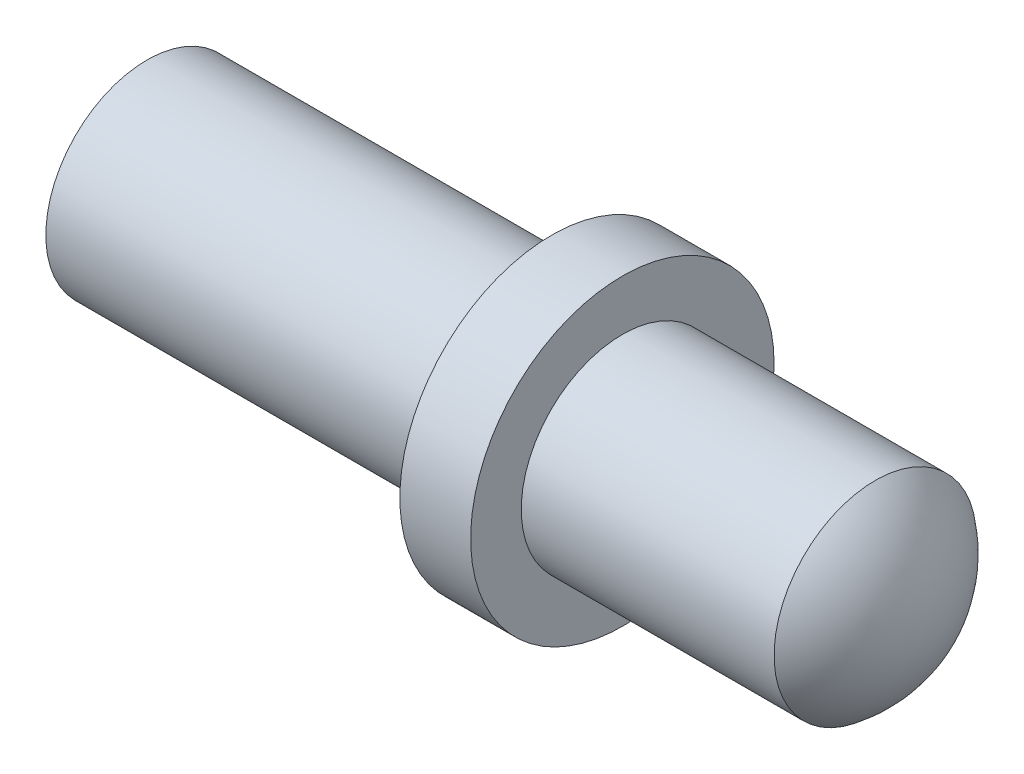
ISO-10303-21;
HEADER;
FILE_DESCRIPTION(('STEP AP214'),'2;1');
FILE_NAME('part.step','',(''),(''),'','','');
FILE_SCHEMA(('AUTOMOTIVE_DESIGN { 1 0 10303 214 1 1 1 1 }'));
ENDSEC;
DATA;
#1=APPLICATION_CONTEXT('core data for automotive mechanical design processes');
#2=APPLICATION_PROTOCOL_DEFINITION('international standard','automotive_design',2000,#1);
#3=PRODUCT_CONTEXT('',#1,'mechanical');
#4=PRODUCT('Part','Part','',(#3));
#5=PRODUCT_RELATED_PRODUCT_CATEGORY('part','',(#4));
#6=PRODUCT_DEFINITION_FORMATION('','',#4);
#7=PRODUCT_DEFINITION_CONTEXT('part definition',#1,'design');
#8=PRODUCT_DEFINITION('design','',#6,#7);
#9=PRODUCT_DEFINITION_SHAPE('','',#8);
#10=(LENGTH_UNIT() NAMED_UNIT(*) SI_UNIT(.MILLI.,.METRE.));
#11=(NAMED_UNIT(*) PLANE_ANGLE_UNIT() SI_UNIT($,.RADIAN.));
#12=(NAMED_UNIT(*) SI_UNIT($,.STERADIAN.) SOLID_ANGLE_UNIT());
#13=UNCERTAINTY_MEASURE_WITH_UNIT(LENGTH_MEASURE(1.E-05),#10,'distance_accuracy_value','');
#14=(GEOMETRIC_REPRESENTATION_CONTEXT(3) GLOBAL_UNCERTAINTY_ASSIGNED_CONTEXT((#13)) GLOBAL_UNIT_ASSIGNED_CONTEXT((#10,
#11,#12)) REPRESENTATION_CONTEXT('',''));
#15=CARTESIAN_POINT('',(0.,0.,0.));
#16=DIRECTION('',(0.,0.,1.));
#17=DIRECTION('',(1.,0.,0.));
#18=AXIS2_PLACEMENT_3D('',#15,#16,#17);
#19=CARTESIAN_POINT('',(0.,0.,0.));
#20=DIRECTION('',(-1.,0.,0.));
#21=DIRECTION('',(0.,0.,1.));
#22=AXIS2_PLACEMENT_3D('',#19,#20,#21);
#23=PLANE('',#22);
#24=CARTESIAN_POINT('',(0.,0.,0.));
#25=DIRECTION('',(1.,0.,0.));
#26=DIRECTION('',(0.,0.,-1.));
#27=AXIS2_PLACEMENT_3D('',#24,#25,#26);
#28=CIRCLE('',#27,2.);
#29=CARTESIAN_POINT('',(0.,0.,-2.));
#30=VERTEX_POINT('',#29);
#31=EDGE_CURVE('E10',#30,#30,#28,.T.);
#32=ORIENTED_EDGE('',*,*,#31,.F.);
#33=EDGE_LOOP('',(#32));
#34=FACE_BOUND('',#33,.T.);
#35=ADVANCED_FACE('F30',(#34),#23,.T.);
#36=CARTESIAN_POINT('',(14.4,0.,0.));
#37=DIRECTION('',(1.,0.,0.));
#38=DIRECTION('',(0.,0.,-1.));
#39=AXIS2_PLACEMENT_3D('',#36,#37,#38);
#40=CYLINDRICAL_SURFACE('',#39,2.);
#41=ORIENTED_EDGE('',*,*,#31,.T.);
#42=EDGE_LOOP('',(#41));
#43=FACE_BOUND('',#42,.T.);
#44=CARTESIAN_POINT('',(8.,0.,0.));
#45=DIRECTION('',(1.,0.,0.));
#46=DIRECTION('',(0.,0.,-1.));
#47=AXIS2_PLACEMENT_3D('',#44,#45,#46);
#48=CIRCLE('',#47,2.);
#49=CARTESIAN_POINT('',(8.,0.,-2.));
#50=VERTEX_POINT('',#49);
#51=EDGE_CURVE('E38',#50,#50,#48,.T.);
#52=ORIENTED_EDGE('',*,*,#51,.F.);
#53=EDGE_LOOP('',(#52));
#54=FACE_BOUND('',#53,.T.);
#55=ADVANCED_FACE('F74',(#43,#54),#40,.T.);
#56=CARTESIAN_POINT('',(8.,2.,0.));
#57=DIRECTION('',(-1.,0.,0.));
#58=DIRECTION('',(0.,0.,1.));
#59=AXIS2_PLACEMENT_3D('',#56,#57,#58);
#60=PLANE('',#59);
#61=ORIENTED_EDGE('',*,*,#51,.T.);
#62=EDGE_LOOP('',(#61));
#63=FACE_BOUND('',#62,.T.);
#64=CARTESIAN_POINT('',(8.,0.,0.));
#65=DIRECTION('',(1.,0.,0.));
#66=DIRECTION('',(0.,0.,-1.));
#67=AXIS2_PLACEMENT_3D('',#64,#65,#66);
#68=CIRCLE('',#67,3.);
#69=CARTESIAN_POINT('',(8.,0.,-3.));
#70=VERTEX_POINT('',#69);
#71=EDGE_CURVE('E42',#70,#70,#68,.T.);
#72=ORIENTED_EDGE('',*,*,#71,.F.);
#73=EDGE_LOOP('',(#72));
#74=FACE_BOUND('',#73,.T.);
#75=ADVANCED_FACE('F78',(#63,#74),#60,.T.);
#76=CARTESIAN_POINT('',(14.4,0.,0.));
#77=DIRECTION('',(1.,0.,0.));
#78=DIRECTION('',(0.,0.,-1.));
#79=AXIS2_PLACEMENT_3D('',#76,#77,#78);
#80=CYLINDRICAL_SURFACE('',#79,3.);
#81=ORIENTED_EDGE('',*,*,#71,.T.);
#82=EDGE_LOOP('',(#81));
#83=FACE_BOUND('',#82,.T.);
#84=CARTESIAN_POINT('',(9.4,0.,0.));
#85=DIRECTION('',(1.,0.,0.));
#86=DIRECTION('',(0.,0.,-1.));
#87=AXIS2_PLACEMENT_3D('',#84,#85,#86);
#88=CIRCLE('',#87,3.);
#89=CARTESIAN_POINT('',(9.4,0.,-3.));
#90=VERTEX_POINT('',#89);
#91=EDGE_CURVE('E47',#90,#90,#88,.T.);
#92=ORIENTED_EDGE('',*,*,#91,.F.);
#93=EDGE_LOOP('',(#92));
#94=FACE_BOUND('',#93,.T.);
#95=ADVANCED_FACE('F70',(#83,#94),#80,.T.);
#96=CARTESIAN_POINT('',(9.4,3.,0.));
#97=DIRECTION('',(1.,0.,0.));
#98=DIRECTION('',(0.,0.,-1.));
#99=AXIS2_PLACEMENT_3D('',#96,#97,#98);
#100=PLANE('',#99);
#101=ORIENTED_EDGE('',*,*,#91,.T.);
#102=EDGE_LOOP('',(#101));
#103=FACE_BOUND('',#102,.T.);
#104=CARTESIAN_POINT('',(9.4,0.,0.));
#105=DIRECTION('',(1.,0.,0.));
#106=DIRECTION('',(0.,0.,-1.));
#107=AXIS2_PLACEMENT_3D('',#104,#105,#106);
#108=CIRCLE('',#107,1.99999999999999);
#109=CARTESIAN_POINT('',(9.4,0.,-1.99999999999999));
#110=VERTEX_POINT('',#109);
#111=EDGE_CURVE('E50',#110,#110,#108,.T.);
#112=ORIENTED_EDGE('',*,*,#111,.F.);
#113=EDGE_LOOP('',(#112));
#114=FACE_BOUND('',#113,.T.);
#115=ADVANCED_FACE('F64',(#103,#114),#100,.T.);
#116=CARTESIAN_POINT('',(14.4,0.,0.));
#117=DIRECTION('',(1.,0.,0.));
#118=DIRECTION('',(0.,0.,-1.));
#119=AXIS2_PLACEMENT_3D('',#116,#117,#118);
#120=CYLINDRICAL_SURFACE('',#119,1.99999999999999);
#121=ORIENTED_EDGE('',*,*,#111,.T.);
#122=EDGE_LOOP('',(#121));
#123=FACE_BOUND('',#122,.T.);
#124=CARTESIAN_POINT('',(14.4,0.,0.));
#125=DIRECTION('',(1.,0.,0.));
#126=DIRECTION('',(0.,0.,-1.));
#127=AXIS2_PLACEMENT_3D('',#124,#125,#126);
#128=CIRCLE('',#127,1.99999999999999);
#129=CARTESIAN_POINT('',(14.4,0.,-1.99999999999999));
#130=VERTEX_POINT('',#129);
#131=EDGE_CURVE('E34',#130,#130,#128,.T.);
#132=ORIENTED_EDGE('',*,*,#131,.F.);
#133=EDGE_LOOP('',(#132));
#134=FACE_BOUND('',#133,.T.);
#135=ADVANCED_FACE('F62',(#123,#134),#120,.T.);
#136=CARTESIAN_POINT('',(12.9,0.,0.));
#137=DIRECTION('',(0.,0.,1.));
#138=DIRECTION('',(1.,0.,0.));
#139=AXIS2_PLACEMENT_3D('',#136,#137,#138);
#140=SPHERICAL_SURFACE('',#139,2.49999999999999);
#141=CARTESIAN_POINT('',(12.9,0.,0.));
#142=DIRECTION('',(1.,0.,0.));
#143=DIRECTION('',(0.,0.,-1.));
#144=AXIS2_PLACEMENT_3D('',#141,#142,#143);
#145=SPHERICAL_SURFACE('',#144,2.49999999999999);
#146=ORIENTED_EDGE('',*,*,#131,.T.);
#147=EDGE_LOOP('',(#146));
#148=FACE_BOUND('',#147,.T.);
#149=ADVANCED_FACE('F32',(#148),#145,.T.);
#150=CLOSED_SHELL('',(#35,#55,#75,#95,#115,#135,#149));
#151=MANIFOLD_SOLID_BREP('B2',#150);
#152=ADVANCED_BREP_SHAPE_REPRESENTATION('',(#18,#151),#14);
#153=SHAPE_DEFINITION_REPRESENTATION(#9,#152);
ENDSEC;
END-ISO-10303-21;
